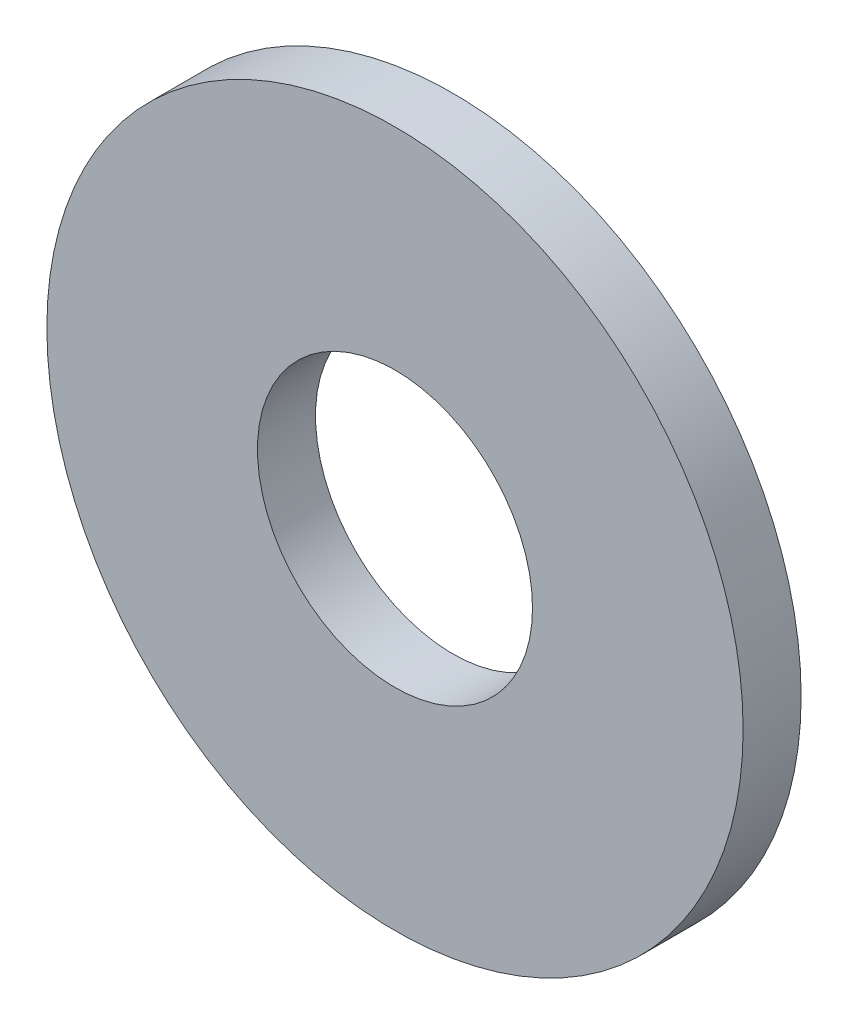
ISO-10303-21;
HEADER;
FILE_DESCRIPTION(('STEP AP214'),'2;1');
FILE_NAME('part.step','',(''),(''),'','','');
FILE_SCHEMA(('AUTOMOTIVE_DESIGN { 1 0 10303 214 1 1 1 1 }'));
ENDSEC;
DATA;
#1=APPLICATION_CONTEXT('core data for automotive mechanical design processes');
#2=APPLICATION_PROTOCOL_DEFINITION('international standard','automotive_design',2000,#1);
#3=PRODUCT_CONTEXT('',#1,'mechanical');
#4=PRODUCT('Part','Part','',(#3));
#5=PRODUCT_RELATED_PRODUCT_CATEGORY('part','',(#4));
#6=PRODUCT_DEFINITION_FORMATION('','',#4);
#7=PRODUCT_DEFINITION_CONTEXT('part definition',#1,'design');
#8=PRODUCT_DEFINITION('design','',#6,#7);
#9=PRODUCT_DEFINITION_SHAPE('','',#8);
#10=(LENGTH_UNIT() NAMED_UNIT(*) SI_UNIT(.MILLI.,.METRE.));
#11=(NAMED_UNIT(*) PLANE_ANGLE_UNIT() SI_UNIT($,.RADIAN.));
#12=(NAMED_UNIT(*) SI_UNIT($,.STERADIAN.) SOLID_ANGLE_UNIT());
#13=UNCERTAINTY_MEASURE_WITH_UNIT(LENGTH_MEASURE(1.E-05),#10,'distance_accuracy_value','');
#14=(GEOMETRIC_REPRESENTATION_CONTEXT(3) GLOBAL_UNCERTAINTY_ASSIGNED_CONTEXT((#13)) GLOBAL_UNIT_ASSIGNED_CONTEXT((#10,
#11,#12)) REPRESENTATION_CONTEXT('',''));
#15=CARTESIAN_POINT('',(0.,0.,0.));
#16=DIRECTION('',(0.,0.,1.));
#17=DIRECTION('',(1.,0.,0.));
#18=AXIS2_PLACEMENT_3D('',#15,#16,#17);
#19=CARTESIAN_POINT('',(0.,0.,6.35));
#20=DIRECTION('',(0.,0.,-1.));
#21=DIRECTION('',(-1.,0.,0.));
#22=AXIS2_PLACEMENT_3D('',#19,#20,#21);
#23=CYLINDRICAL_SURFACE('',#22,38.1);
#24=CARTESIAN_POINT('',(0.,0.,6.35));
#25=DIRECTION('',(0.,0.,1.));
#26=DIRECTION('',(1.,0.,0.));
#27=AXIS2_PLACEMENT_3D('',#24,#25,#26);
#28=CIRCLE('',#27,38.1);
#29=CARTESIAN_POINT('',(38.1,0.,6.35));
#30=VERTEX_POINT('',#29);
#31=EDGE_CURVE('E10',#30,#30,#28,.T.);
#32=ORIENTED_EDGE('',*,*,#31,.F.);
#33=EDGE_LOOP('',(#32));
#34=FACE_BOUND('',#33,.T.);
#35=CARTESIAN_POINT('',(0.,0.,0.));
#36=DIRECTION('',(0.,0.,1.));
#37=DIRECTION('',(1.,0.,0.));
#38=AXIS2_PLACEMENT_3D('',#35,#36,#37);
#39=CIRCLE('',#38,38.1);
#40=CARTESIAN_POINT('',(38.1,0.,0.));
#41=VERTEX_POINT('',#40);
#42=EDGE_CURVE('E40',#41,#41,#39,.T.);
#43=ORIENTED_EDGE('',*,*,#42,.T.);
#44=EDGE_LOOP('',(#43));
#45=FACE_BOUND('',#44,.T.);
#46=ADVANCED_FACE('F37',(#34,#45),#23,.T.);
#47=CARTESIAN_POINT('',(0.,0.,6.35));
#48=DIRECTION('',(0.,0.,1.));
#49=DIRECTION('',(1.,0.,0.));
#50=AXIS2_PLACEMENT_3D('',#47,#48,#49);
#51=PLANE('',#50);
#52=CARTESIAN_POINT('',(0.,0.,6.35));
#53=DIRECTION('',(0.,0.,1.));
#54=DIRECTION('',(1.,0.,0.));
#55=AXIS2_PLACEMENT_3D('',#52,#53,#54);
#56=CIRCLE('',#55,15.05);
#57=CARTESIAN_POINT('',(15.05,0.,6.35));
#58=VERTEX_POINT('',#57);
#59=EDGE_CURVE('E49',#58,#58,#56,.T.);
#60=ORIENTED_EDGE('',*,*,#59,.F.);
#61=EDGE_LOOP('',(#60));
#62=FACE_BOUND('',#61,.T.);
#63=ORIENTED_EDGE('',*,*,#31,.T.);
#64=EDGE_LOOP('',(#63));
#65=FACE_BOUND('',#64,.T.);
#66=ADVANCED_FACE('F64',(#62,#65),#51,.T.);
#67=CARTESIAN_POINT('',(0.,0.,0.));
#68=DIRECTION('',(0.,0.,1.));
#69=DIRECTION('',(1.,0.,0.));
#70=AXIS2_PLACEMENT_3D('',#67,#68,#69);
#71=PLANE('',#70);
#72=CARTESIAN_POINT('',(0.,0.,0.));
#73=DIRECTION('',(0.,0.,1.));
#74=DIRECTION('',(1.,0.,0.));
#75=AXIS2_PLACEMENT_3D('',#72,#73,#74);
#76=CIRCLE('',#75,15.05);
#77=CARTESIAN_POINT('',(15.05,0.,0.));
#78=VERTEX_POINT('',#77);
#79=EDGE_CURVE('E47',#78,#78,#76,.T.);
#80=ORIENTED_EDGE('',*,*,#79,.T.);
#81=EDGE_LOOP('',(#80));
#82=FACE_BOUND('',#81,.T.);
#83=ORIENTED_EDGE('',*,*,#42,.F.);
#84=EDGE_LOOP('',(#83));
#85=FACE_BOUND('',#84,.T.);
#86=ADVANCED_FACE('F55',(#82,#85),#71,.F.);
#87=CARTESIAN_POINT('',(0.,0.,0.));
#88=DIRECTION('',(0.,0.,1.));
#89=DIRECTION('',(1.,0.,0.));
#90=AXIS2_PLACEMENT_3D('',#87,#88,#89);
#91=CYLINDRICAL_SURFACE('',#90,15.05);
#92=ORIENTED_EDGE('',*,*,#79,.F.);
#93=EDGE_LOOP('',(#92));
#94=FACE_BOUND('',#93,.T.);
#95=ORIENTED_EDGE('',*,*,#59,.T.);
#96=EDGE_LOOP('',(#95));
#97=FACE_BOUND('',#96,.T.);
#98=ADVANCED_FACE('F58',(#94,#97),#91,.F.);
#99=CLOSED_SHELL('',(#46,#66,#86,#98));
#100=MANIFOLD_SOLID_BREP('B2',#99);
#101=ADVANCED_BREP_SHAPE_REPRESENTATION('',(#18,#100),#14);
#102=SHAPE_DEFINITION_REPRESENTATION(#9,#101);
ENDSEC;
END-ISO-10303-21;
